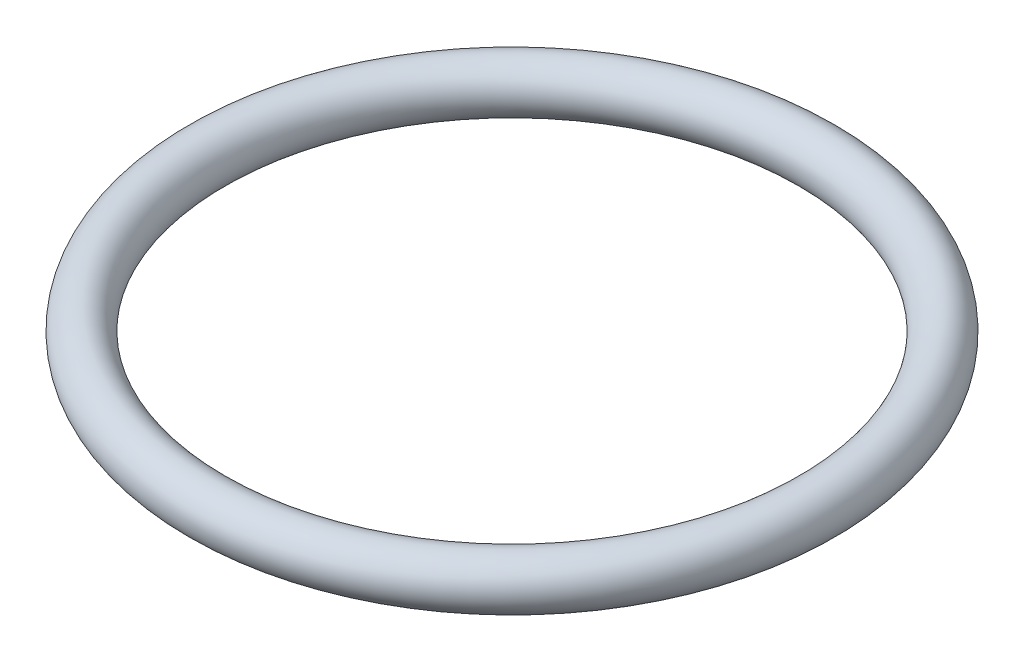
ISO-10303-21;
HEADER;
FILE_DESCRIPTION(('STEP AP214'),'2;1');
FILE_NAME('part.step','',(''),(''),'','','');
FILE_SCHEMA(('AUTOMOTIVE_DESIGN { 1 0 10303 214 1 1 1 1 }'));
ENDSEC;
DATA;
#1=APPLICATION_CONTEXT('core data for automotive mechanical design processes');
#2=APPLICATION_PROTOCOL_DEFINITION('international standard','automotive_design',2000,#1);
#3=PRODUCT_CONTEXT('',#1,'mechanical');
#4=PRODUCT('Part','Part','',(#3));
#5=PRODUCT_RELATED_PRODUCT_CATEGORY('part','',(#4));
#6=PRODUCT_DEFINITION_FORMATION('','',#4);
#7=PRODUCT_DEFINITION_CONTEXT('part definition',#1,'design');
#8=PRODUCT_DEFINITION('design','',#6,#7);
#9=PRODUCT_DEFINITION_SHAPE('','',#8);
#10=(LENGTH_UNIT() NAMED_UNIT(*) SI_UNIT(.MILLI.,.METRE.));
#11=(NAMED_UNIT(*) PLANE_ANGLE_UNIT() SI_UNIT($,.RADIAN.));
#12=(NAMED_UNIT(*) SI_UNIT($,.STERADIAN.) SOLID_ANGLE_UNIT());
#13=UNCERTAINTY_MEASURE_WITH_UNIT(LENGTH_MEASURE(1.E-05),#10,'distance_accuracy_value','');
#14=(GEOMETRIC_REPRESENTATION_CONTEXT(3) GLOBAL_UNCERTAINTY_ASSIGNED_CONTEXT((#13)) GLOBAL_UNIT_ASSIGNED_CONTEXT((#10,
#11,#12)) REPRESENTATION_CONTEXT('',''));
#15=CARTESIAN_POINT('',(0.,0.,0.));
#16=DIRECTION('',(0.,0.,1.));
#17=DIRECTION('',(1.,0.,0.));
#18=AXIS2_PLACEMENT_3D('',#15,#16,#17);
#19=CARTESIAN_POINT('',(0.,0.,0.));
#20=DIRECTION('',(0.,-1.,0.));
#21=DIRECTION('',(0.,0.,-1.));
#22=AXIS2_PLACEMENT_3D('',#19,#20,#21);
#23=TOROIDAL_SURFACE('',#22,8.5,0.7);
#24=CARTESIAN_POINT('',(0.,0.,-9.2));
#25=VERTEX_POINT('',#24);
#26=VERTEX_LOOP('',#25);
#27=FACE_BOUND('',#26,.T.);
#28=ADVANCED_FACE('F32',(#27),#23,.T.);
#29=CLOSED_SHELL('',(#28));
#30=MANIFOLD_SOLID_BREP('B2',#29);
#31=ADVANCED_BREP_SHAPE_REPRESENTATION('',(#18,#30),#14);
#32=SHAPE_DEFINITION_REPRESENTATION(#9,#31);
ENDSEC;
END-ISO-10303-21;
